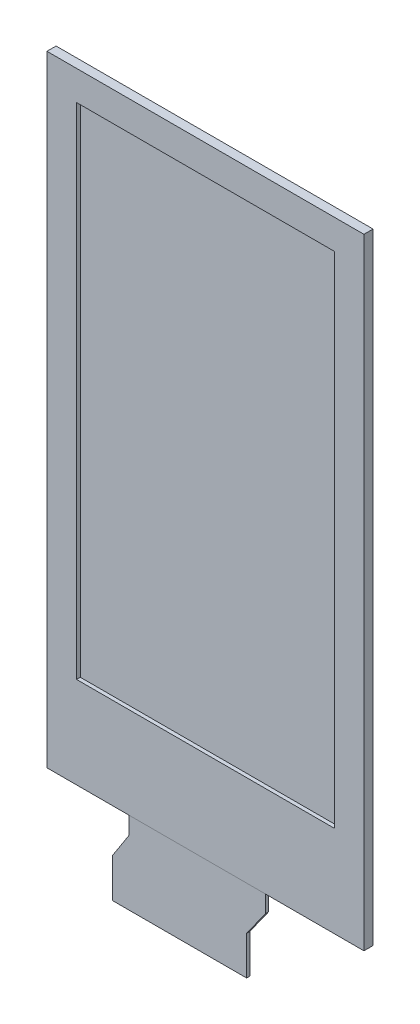
ISO-10303-21;
HEADER;
FILE_DESCRIPTION(('STEP AP214'),'2;1');
FILE_NAME('part.step','',(''),(''),'','','');
FILE_SCHEMA(('AUTOMOTIVE_DESIGN { 1 0 10303 214 1 1 1 1 }'));
ENDSEC;
DATA;
#1=APPLICATION_CONTEXT('core data for automotive mechanical design processes');
#2=APPLICATION_PROTOCOL_DEFINITION('international standard','automotive_design',2000,#1);
#3=PRODUCT_CONTEXT('',#1,'mechanical');
#4=PRODUCT('Part','Part','',(#3));
#5=PRODUCT_RELATED_PRODUCT_CATEGORY('part','',(#4));
#6=PRODUCT_DEFINITION_FORMATION('','',#4);
#7=PRODUCT_DEFINITION_CONTEXT('part definition',#1,'design');
#8=PRODUCT_DEFINITION('design','',#6,#7);
#9=PRODUCT_DEFINITION_SHAPE('','',#8);
#10=(LENGTH_UNIT() NAMED_UNIT(*) SI_UNIT(.MILLI.,.METRE.));
#11=(NAMED_UNIT(*) PLANE_ANGLE_UNIT() SI_UNIT($,.RADIAN.));
#12=(NAMED_UNIT(*) SI_UNIT($,.STERADIAN.) SOLID_ANGLE_UNIT());
#13=UNCERTAINTY_MEASURE_WITH_UNIT(LENGTH_MEASURE(1.E-05),#10,'distance_accuracy_value','');
#14=(GEOMETRIC_REPRESENTATION_CONTEXT(3) GLOBAL_UNCERTAINTY_ASSIGNED_CONTEXT((#13)) GLOBAL_UNIT_ASSIGNED_CONTEXT((#10,
#11,#12)) REPRESENTATION_CONTEXT('',''));
#15=CARTESIAN_POINT('',(0.,0.,0.));
#16=DIRECTION('',(0.,0.,1.));
#17=DIRECTION('',(1.,0.,0.));
#18=AXIS2_PLACEMENT_3D('',#15,#16,#17);
#19=CARTESIAN_POINT('',(19.4468212315687,-13.8527761819744,0.8));
#20=DIRECTION('',(-0.814481793298275,0.58018911432879,0.));
#21=DIRECTION('',(-0.58018911432879,-0.814481793298275,0.));
#22=AXIS2_PLACEMENT_3D('',#19,#20,#21);
#23=PLANE('',#22);
#24=DIRECTION('',(0.580189114328791,0.814481793298275,0.));
#25=VECTOR('',#24,1.);
#26=CARTESIAN_POINT('',(19.4468212315687,-13.8527761819744,0.5));
#27=LINE('',#26,#25);
#28=CARTESIAN_POINT('',(3.778,-35.849,0.5));
#29=VERTEX_POINT('',#28);
#30=CARTESIAN_POINT('',(5.51818223855442,-33.4060952378806,0.5));
#31=VERTEX_POINT('',#30);
#32=EDGE_CURVE('E144',#29,#31,#27,.T.);
#33=ORIENTED_EDGE('',*,*,#32,.T.);
#34=DIRECTION('',(0.,0.,-1.));
#35=VECTOR('',#34,1.);
#36=CARTESIAN_POINT('',(5.51818223855442,-33.4060952378806,0.8));
#37=LINE('',#36,#35);
#38=CARTESIAN_POINT('',(5.51818223855442,-33.4060952378806,0.8));
#39=VERTEX_POINT('',#38);
#40=EDGE_CURVE('E12',#39,#31,#37,.T.);
#41=ORIENTED_EDGE('',*,*,#40,.F.);
#42=DIRECTION('',(0.580189114328791,0.814481793298275,0.));
#43=VECTOR('',#42,1.);
#44=CARTESIAN_POINT('',(19.4468212315687,-13.8527761819744,0.8));
#45=LINE('',#44,#43);
#46=CARTESIAN_POINT('',(3.778,-35.849,0.8));
#47=VERTEX_POINT('',#46);
#48=EDGE_CURVE('E158',#47,#39,#45,.T.);
#49=ORIENTED_EDGE('',*,*,#48,.F.);
#50=DIRECTION('',(0.,0.,-1.));
#51=VECTOR('',#50,1.);
#52=CARTESIAN_POINT('',(3.778,-35.849,0.8));
#53=LINE('',#52,#51);
#54=EDGE_CURVE('E140',#47,#29,#53,.T.);
#55=ORIENTED_EDGE('',*,*,#54,.T.);
#56=EDGE_LOOP('',(#33,#41,#49,#55));
#57=FACE_BOUND('',#56,.T.);
#58=ADVANCED_FACE('F48',(#57),#23,.F.);
#59=CARTESIAN_POINT('',(5.51818223855444,0.,0.8));
#60=DIRECTION('',(-1.,0.,0.));
#61=DIRECTION('',(0.,-1.,0.));
#62=AXIS2_PLACEMENT_3D('',#59,#60,#61);
#63=PLANE('',#62);
#64=DIRECTION('',(0.,1.,0.));
#65=VECTOR('',#64,1.);
#66=CARTESIAN_POINT('',(5.51818223855444,0.,0.5));
#67=LINE('',#66,#65);
#68=CARTESIAN_POINT('',(5.51818223855443,-31.75,0.5));
#69=VERTEX_POINT('',#68);
#70=EDGE_CURVE('E147',#31,#69,#67,.T.);
#71=ORIENTED_EDGE('',*,*,#70,.T.);
#72=DIRECTION('',(0.,0.,-1.));
#73=VECTOR('',#72,1.);
#74=CARTESIAN_POINT('',(5.51818223855443,-31.75,0.8));
#75=LINE('',#74,#73);
#76=CARTESIAN_POINT('',(5.51818223855443,-31.75,0.8));
#77=VERTEX_POINT('',#76);
#78=EDGE_CURVE('E56',#77,#69,#75,.T.);
#79=ORIENTED_EDGE('',*,*,#78,.F.);
#80=DIRECTION('',(0.,1.,0.));
#81=VECTOR('',#80,1.);
#82=CARTESIAN_POINT('',(5.51818223855444,0.,0.8));
#83=LINE('',#82,#81);
#84=EDGE_CURVE('E107',#39,#77,#83,.T.);
#85=ORIENTED_EDGE('',*,*,#84,.F.);
#86=ORIENTED_EDGE('',*,*,#40,.T.);
#87=EDGE_LOOP('',(#71,#79,#85,#86));
#88=FACE_BOUND('',#87,.T.);
#89=ADVANCED_FACE('F193',(#88),#63,.F.);
#90=CARTESIAN_POINT('',(0.,-31.75,0.8));
#91=DIRECTION('',(0.,-1.,0.));
#92=DIRECTION('',(0.,0.,-1.));
#93=AXIS2_PLACEMENT_3D('',#90,#91,#92);
#94=PLANE('',#93);
#95=DIRECTION('',(-1.,0.,0.));
#96=VECTOR('',#95,1.);
#97=CARTESIAN_POINT('',(0.,-31.75,0.5));
#98=LINE('',#97,#96);
#99=CARTESIAN_POINT('',(-7.152,-31.75,0.5));
#100=VERTEX_POINT('',#99);
#101=EDGE_CURVE('E149',#69,#100,#98,.T.);
#102=ORIENTED_EDGE('',*,*,#101,.T.);
#103=DIRECTION('',(0.,0.,-1.));
#104=VECTOR('',#103,1.);
#105=CARTESIAN_POINT('',(-7.152,-31.75,0.8));
#106=LINE('',#105,#104);
#107=CARTESIAN_POINT('',(-7.152,-31.75,0.8));
#108=VERTEX_POINT('',#107);
#109=EDGE_CURVE('E165',#108,#100,#106,.T.);
#110=ORIENTED_EDGE('',*,*,#109,.F.);
#111=DIRECTION('',(-1.,0.,0.));
#112=VECTOR('',#111,1.);
#113=CARTESIAN_POINT('',(0.,-31.75,0.8));
#114=LINE('',#113,#112);
#115=EDGE_CURVE('E173',#77,#108,#114,.T.);
#116=ORIENTED_EDGE('',*,*,#115,.F.);
#117=ORIENTED_EDGE('',*,*,#78,.T.);
#118=EDGE_LOOP('',(#102,#110,#116,#117));
#119=FACE_BOUND('',#118,.T.);
#120=ADVANCED_FACE('F171',(#119),#94,.F.);
#121=CARTESIAN_POINT('',(-7.152,0.,0.8));
#122=DIRECTION('',(1.,0.,0.));
#123=DIRECTION('',(0.,0.,-1.));
#124=AXIS2_PLACEMENT_3D('',#121,#122,#123);
#125=PLANE('',#124);
#126=DIRECTION('',(0.,-1.,0.));
#127=VECTOR('',#126,1.);
#128=CARTESIAN_POINT('',(-7.152,0.,0.5));
#129=LINE('',#128,#127);
#130=CARTESIAN_POINT('',(-7.152,-33.4060952378806,0.5));
#131=VERTEX_POINT('',#130);
#132=EDGE_CURVE('E151',#100,#131,#129,.T.);
#133=ORIENTED_EDGE('',*,*,#132,.T.);
#134=DIRECTION('',(0.,0.,-1.));
#135=VECTOR('',#134,1.);
#136=CARTESIAN_POINT('',(-7.152,-33.4060952378806,0.8));
#137=LINE('',#136,#135);
#138=CARTESIAN_POINT('',(-7.152,-33.4060952378806,0.8));
#139=VERTEX_POINT('',#138);
#140=EDGE_CURVE('E162',#139,#131,#137,.T.);
#141=ORIENTED_EDGE('',*,*,#140,.F.);
#142=DIRECTION('',(0.,-1.,0.));
#143=VECTOR('',#142,1.);
#144=CARTESIAN_POINT('',(-7.152,0.,0.8));
#145=LINE('',#144,#143);
#146=EDGE_CURVE('E185',#108,#139,#145,.T.);
#147=ORIENTED_EDGE('',*,*,#146,.F.);
#148=ORIENTED_EDGE('',*,*,#109,.T.);
#149=EDGE_LOOP('',(#133,#141,#147,#148));
#150=FACE_BOUND('',#149,.T.);
#151=ADVANCED_FACE('F181',(#150),#125,.F.);
#152=CARTESIAN_POINT('',(10.1323412295573,-6.51182804056761,0.8));
#153=DIRECTION('',(0.841247199222074,-0.540650672616817,0.));
#154=DIRECTION('',(0.540650672616817,0.841247199222074,0.));
#155=AXIS2_PLACEMENT_3D('',#152,#153,#154);
#156=PLANE('',#155);
#157=DIRECTION('',(-0.540650672616817,-0.841247199222074,0.));
#158=VECTOR('',#157,1.);
#159=CARTESIAN_POINT('',(10.1323412295573,-6.51182804056761,0.5));
#160=LINE('',#159,#158);
#161=CARTESIAN_POINT('',(-8.722,-35.849,0.5));
#162=VERTEX_POINT('',#161);
#163=EDGE_CURVE('E153',#131,#162,#160,.T.);
#164=ORIENTED_EDGE('',*,*,#163,.T.);
#165=DIRECTION('',(0.,0.,-1.));
#166=VECTOR('',#165,1.);
#167=CARTESIAN_POINT('',(-8.722,-35.849,0.8));
#168=LINE('',#167,#166);
#169=CARTESIAN_POINT('',(-8.722,-35.849,0.8));
#170=VERTEX_POINT('',#169);
#171=EDGE_CURVE('E135',#170,#162,#168,.T.);
#172=ORIENTED_EDGE('',*,*,#171,.F.);
#173=DIRECTION('',(-0.540650672616817,-0.841247199222074,0.));
#174=VECTOR('',#173,1.);
#175=CARTESIAN_POINT('',(10.1323412295573,-6.51182804056761,0.8));
#176=LINE('',#175,#174);
#177=EDGE_CURVE('E126',#139,#170,#176,.T.);
#178=ORIENTED_EDGE('',*,*,#177,.F.);
#179=ORIENTED_EDGE('',*,*,#140,.T.);
#180=EDGE_LOOP('',(#164,#172,#178,#179));
#181=FACE_BOUND('',#180,.T.);
#182=ADVANCED_FACE('F184',(#181),#156,.F.);
#183=CARTESIAN_POINT('',(-8.722,0.,0.8));
#184=DIRECTION('',(1.,0.,0.));
#185=DIRECTION('',(0.,0.,-1.));
#186=AXIS2_PLACEMENT_3D('',#183,#184,#185);
#187=PLANE('',#186);
#188=DIRECTION('',(0.,-1.,0.));
#189=VECTOR('',#188,1.);
#190=CARTESIAN_POINT('',(-8.722,0.,0.5));
#191=LINE('',#190,#189);
#192=CARTESIAN_POINT('',(-8.722,-39.45,0.5));
#193=VERTEX_POINT('',#192);
#194=EDGE_CURVE('E134',#162,#193,#191,.T.);
#195=ORIENTED_EDGE('',*,*,#194,.T.);
#196=DIRECTION('',(0.,0.,-1.));
#197=VECTOR('',#196,1.);
#198=CARTESIAN_POINT('',(-8.722,-39.45,0.8));
#199=LINE('',#198,#197);
#200=CARTESIAN_POINT('',(-8.722,-39.45,0.8));
#201=VERTEX_POINT('',#200);
#202=EDGE_CURVE('E131',#201,#193,#199,.T.);
#203=ORIENTED_EDGE('',*,*,#202,.F.);
#204=DIRECTION('',(0.,-1.,0.));
#205=VECTOR('',#204,1.);
#206=CARTESIAN_POINT('',(-8.722,0.,0.8));
#207=LINE('',#206,#205);
#208=EDGE_CURVE('E120',#170,#201,#207,.T.);
#209=ORIENTED_EDGE('',*,*,#208,.F.);
#210=ORIENTED_EDGE('',*,*,#171,.T.);
#211=EDGE_LOOP('',(#195,#203,#209,#210));
#212=FACE_BOUND('',#211,.T.);
#213=ADVANCED_FACE('F132',(#212),#187,.F.);
#214=CARTESIAN_POINT('',(0.,-39.45,0.8));
#215=DIRECTION('',(0.,1.,0.));
#216=DIRECTION('',(0.,0.,1.));
#217=AXIS2_PLACEMENT_3D('',#214,#215,#216);
#218=PLANE('',#217);
#219=DIRECTION('',(1.,0.,0.));
#220=VECTOR('',#219,1.);
#221=CARTESIAN_POINT('',(0.,-39.45,0.5));
#222=LINE('',#221,#220);
#223=CARTESIAN_POINT('',(3.778,-39.45,0.5));
#224=VERTEX_POINT('',#223);
#225=EDGE_CURVE('E93',#193,#224,#222,.T.);
#226=ORIENTED_EDGE('',*,*,#225,.T.);
#227=DIRECTION('',(0.,0.,-1.));
#228=VECTOR('',#227,1.);
#229=CARTESIAN_POINT('',(3.778,-39.45,0.8));
#230=LINE('',#229,#228);
#231=CARTESIAN_POINT('',(3.778,-39.45,0.8));
#232=VERTEX_POINT('',#231);
#233=EDGE_CURVE('E136',#232,#224,#230,.T.);
#234=ORIENTED_EDGE('',*,*,#233,.F.);
#235=DIRECTION('',(1.,0.,0.));
#236=VECTOR('',#235,1.);
#237=CARTESIAN_POINT('',(0.,-39.45,0.8));
#238=LINE('',#237,#236);
#239=EDGE_CURVE('E124',#201,#232,#238,.T.);
#240=ORIENTED_EDGE('',*,*,#239,.F.);
#241=ORIENTED_EDGE('',*,*,#202,.T.);
#242=EDGE_LOOP('',(#226,#234,#240,#241));
#243=FACE_BOUND('',#242,.T.);
#244=ADVANCED_FACE('F138',(#243),#218,.F.);
#245=CARTESIAN_POINT('',(3.778,0.,0.8));
#246=DIRECTION('',(-1.,0.,0.));
#247=DIRECTION('',(0.,0.,1.));
#248=AXIS2_PLACEMENT_3D('',#245,#246,#247);
#249=PLANE('',#248);
#250=DIRECTION('',(0.,1.,0.));
#251=VECTOR('',#250,1.);
#252=CARTESIAN_POINT('',(3.778,0.,0.5));
#253=LINE('',#252,#251);
#254=EDGE_CURVE('E99',#224,#29,#253,.T.);
#255=ORIENTED_EDGE('',*,*,#254,.T.);
#256=ORIENTED_EDGE('',*,*,#54,.F.);
#257=DIRECTION('',(0.,1.,0.));
#258=VECTOR('',#257,1.);
#259=CARTESIAN_POINT('',(3.778,0.,0.8));
#260=LINE('',#259,#258);
#261=EDGE_CURVE('E64',#232,#47,#260,.T.);
#262=ORIENTED_EDGE('',*,*,#261,.F.);
#263=ORIENTED_EDGE('',*,*,#233,.T.);
#264=EDGE_LOOP('',(#255,#256,#262,#263));
#265=FACE_BOUND('',#264,.T.);
#266=ADVANCED_FACE('F209',(#265),#249,.F.);
#267=CARTESIAN_POINT('',(0.,0.,0.8));
#268=DIRECTION('',(0.,0.,1.));
#269=DIRECTION('',(1.,0.,0.));
#270=AXIS2_PLACEMENT_3D('',#267,#268,#269);
#271=PLANE('',#270);
#272=ORIENTED_EDGE('',*,*,#48,.T.);
#273=ORIENTED_EDGE('',*,*,#84,.T.);
#274=ORIENTED_EDGE('',*,*,#115,.T.);
#275=ORIENTED_EDGE('',*,*,#146,.T.);
#276=ORIENTED_EDGE('',*,*,#177,.T.);
#277=ORIENTED_EDGE('',*,*,#208,.T.);
#278=ORIENTED_EDGE('',*,*,#239,.T.);
#279=ORIENTED_EDGE('',*,*,#261,.T.);
#280=EDGE_LOOP('',(#272,#273,#274,#275,#276,#277,#278,#279));
#281=FACE_BOUND('',#280,.T.);
#282=ADVANCED_FACE('F122',(#281),#271,.T.);
#283=CARTESIAN_POINT('',(0.,0.,0.5));
#284=DIRECTION('',(0.,0.,1.));
#285=DIRECTION('',(1.,0.,0.));
#286=AXIS2_PLACEMENT_3D('',#283,#284,#285);
#287=PLANE('',#286);
#288=ORIENTED_EDGE('',*,*,#32,.F.);
#289=ORIENTED_EDGE('',*,*,#254,.F.);
#290=ORIENTED_EDGE('',*,*,#225,.F.);
#291=ORIENTED_EDGE('',*,*,#194,.F.);
#292=ORIENTED_EDGE('',*,*,#163,.F.);
#293=ORIENTED_EDGE('',*,*,#132,.F.);
#294=ORIENTED_EDGE('',*,*,#101,.F.);
#295=ORIENTED_EDGE('',*,*,#70,.F.);
#296=EDGE_LOOP('',(#288,#289,#290,#291,#292,#293,#294,#295));
#297=FACE_BOUND('',#296,.T.);
#298=ADVANCED_FACE('F177',(#297),#287,.F.);
#299=CLOSED_SHELL('',(#58,#89,#120,#151,#182,#213,#244,#266,#282,#298));
#300=MANIFOLD_SOLID_BREP('B2',#299);
#301=CARTESIAN_POINT('',(0.,26.,0.85));
#302=DIRECTION('',(0.,-1.,0.));
#303=DIRECTION('',(0.,0.,-1.));
#304=AXIS2_PLACEMENT_3D('',#301,#302,#303);
#305=PLANE('',#304);
#306=DIRECTION('',(-1.,0.,0.));
#307=VECTOR('',#306,1.);
#308=CARTESIAN_POINT('',(0.,26.,0.));
#309=LINE('',#308,#307);
#310=CARTESIAN_POINT('',(14.748,26.,0.));
#311=VERTEX_POINT('',#310);
#312=CARTESIAN_POINT('',(-14.752,26.,0.));
#313=VERTEX_POINT('',#312);
#314=EDGE_CURVE('E392',#311,#313,#309,.T.);
#315=ORIENTED_EDGE('',*,*,#314,.T.);
#316=DIRECTION('',(0.,0.,-1.));
#317=VECTOR('',#316,1.);
#318=CARTESIAN_POINT('',(-14.752,26.,0.85));
#319=LINE('',#318,#317);
#320=CARTESIAN_POINT('',(-14.752,26.,0.85));
#321=VERTEX_POINT('',#320);
#322=EDGE_CURVE('E46',#321,#313,#319,.T.);
#323=ORIENTED_EDGE('',*,*,#322,.F.);
#324=DIRECTION('',(-1.,0.,0.));
#325=VECTOR('',#324,1.);
#326=CARTESIAN_POINT('',(0.,26.,0.85));
#327=LINE('',#326,#325);
#328=CARTESIAN_POINT('',(14.748,26.,0.85));
#329=VERTEX_POINT('',#328);
#330=EDGE_CURVE('E364',#329,#321,#327,.T.);
#331=ORIENTED_EDGE('',*,*,#330,.F.);
#332=DIRECTION('',(0.,0.,-1.));
#333=VECTOR('',#332,1.);
#334=CARTESIAN_POINT('',(14.748,26.,0.85));
#335=LINE('',#334,#333);
#336=EDGE_CURVE('E304',#329,#311,#335,.T.);
#337=ORIENTED_EDGE('',*,*,#336,.T.);
#338=EDGE_LOOP('',(#315,#323,#331,#337));
#339=FACE_BOUND('',#338,.T.);
#340=ADVANCED_FACE('F285',(#339),#305,.F.);
#341=CARTESIAN_POINT('',(-14.752,0.,0.85));
#342=DIRECTION('',(1.,0.,0.));
#343=DIRECTION('',(0.,0.,-1.));
#344=AXIS2_PLACEMENT_3D('',#341,#342,#343);
#345=PLANE('',#344);
#346=DIRECTION('',(0.,-1.,0.));
#347=VECTOR('',#346,1.);
#348=CARTESIAN_POINT('',(-14.752,0.,0.));
#349=LINE('',#348,#347);
#350=CARTESIAN_POINT('',(-14.752,-31.75,0.));
#351=VERTEX_POINT('',#350);
#352=EDGE_CURVE('E370',#313,#351,#349,.T.);
#353=ORIENTED_EDGE('',*,*,#352,.T.);
#354=DIRECTION('',(0.,0.,-1.));
#355=VECTOR('',#354,1.);
#356=CARTESIAN_POINT('',(-14.752,-31.75,0.85));
#357=LINE('',#356,#355);
#358=CARTESIAN_POINT('',(-14.752,-31.75,0.85));
#359=VERTEX_POINT('',#358);
#360=EDGE_CURVE('E295',#359,#351,#357,.T.);
#361=ORIENTED_EDGE('',*,*,#360,.F.);
#362=DIRECTION('',(0.,-1.,0.));
#363=VECTOR('',#362,1.);
#364=CARTESIAN_POINT('',(-14.752,0.,0.85));
#365=LINE('',#364,#363);
#366=EDGE_CURVE('E358',#321,#359,#365,.T.);
#367=ORIENTED_EDGE('',*,*,#366,.F.);
#368=ORIENTED_EDGE('',*,*,#322,.T.);
#369=EDGE_LOOP('',(#353,#361,#367,#368));
#370=FACE_BOUND('',#369,.T.);
#371=ADVANCED_FACE('F369',(#370),#345,.F.);
#372=CARTESIAN_POINT('',(0.,-31.75,0.85));
#373=DIRECTION('',(0.,-1.,0.));
#374=DIRECTION('',(0.,0.,-1.));
#375=AXIS2_PLACEMENT_3D('',#372,#373,#374);
#376=PLANE('',#375);
#377=DIRECTION('',(-1.,0.,0.));
#378=VECTOR('',#377,1.);
#379=CARTESIAN_POINT('',(0.,-31.75,0.));
#380=LINE('',#379,#378);
#381=CARTESIAN_POINT('',(14.748,-31.75,0.));
#382=VERTEX_POINT('',#381);
#383=EDGE_CURVE('E395',#382,#351,#380,.T.);
#384=ORIENTED_EDGE('',*,*,#383,.F.);
#385=DIRECTION('',(0.,0.,-1.));
#386=VECTOR('',#385,1.);
#387=CARTESIAN_POINT('',(14.748,-31.75,0.85));
#388=LINE('',#387,#386);
#389=CARTESIAN_POINT('',(14.748,-31.75,0.85));
#390=VERTEX_POINT('',#389);
#391=EDGE_CURVE('E330',#390,#382,#388,.T.);
#392=ORIENTED_EDGE('',*,*,#391,.F.);
#393=DIRECTION('',(-1.,0.,0.));
#394=VECTOR('',#393,1.);
#395=CARTESIAN_POINT('',(0.,-31.75,0.85));
#396=LINE('',#395,#394);
#397=EDGE_CURVE('E363',#390,#359,#396,.T.);
#398=ORIENTED_EDGE('',*,*,#397,.T.);
#399=ORIENTED_EDGE('',*,*,#360,.T.);
#400=EDGE_LOOP('',(#384,#392,#398,#399));
#401=FACE_BOUND('',#400,.T.);
#402=ADVANCED_FACE('F374',(#401),#376,.T.);
#403=CARTESIAN_POINT('',(-12.,0.,0.85));
#404=DIRECTION('',(1.,0.,0.));
#405=DIRECTION('',(0.,0.,-1.));
#406=AXIS2_PLACEMENT_3D('',#403,#404,#405);
#407=PLANE('',#406);
#408=DIRECTION('',(0.,-1.,0.));
#409=VECTOR('',#408,1.);
#410=CARTESIAN_POINT('',(-12.,0.,0.));
#411=LINE('',#410,#409);
#412=CARTESIAN_POINT('',(-12.,23.25,0.));
#413=VERTEX_POINT('',#412);
#414=CARTESIAN_POINT('',(-12.,-23.25,0.));
#415=VERTEX_POINT('',#414);
#416=EDGE_CURVE('E381',#413,#415,#411,.T.);
#417=ORIENTED_EDGE('',*,*,#416,.F.);
#418=DIRECTION('',(0.,0.,-1.));
#419=VECTOR('',#418,1.);
#420=CARTESIAN_POINT('',(-12.,23.25,0.85));
#421=LINE('',#420,#419);
#422=CARTESIAN_POINT('',(-12.,23.25,0.85));
#423=VERTEX_POINT('',#422);
#424=EDGE_CURVE('E289',#423,#413,#421,.T.);
#425=ORIENTED_EDGE('',*,*,#424,.F.);
#426=DIRECTION('',(0.,-1.,0.));
#427=VECTOR('',#426,1.);
#428=CARTESIAN_POINT('',(-12.,0.,0.85));
#429=LINE('',#428,#427);
#430=CARTESIAN_POINT('',(-12.,-23.25,0.85));
#431=VERTEX_POINT('',#430);
#432=EDGE_CURVE('E400',#423,#431,#429,.T.);
#433=ORIENTED_EDGE('',*,*,#432,.T.);
#434=DIRECTION('',(0.,0.,-1.));
#435=VECTOR('',#434,1.);
#436=CARTESIAN_POINT('',(-12.,-23.25,0.85));
#437=LINE('',#436,#435);
#438=EDGE_CURVE('E377',#431,#415,#437,.T.);
#439=ORIENTED_EDGE('',*,*,#438,.T.);
#440=EDGE_LOOP('',(#417,#425,#433,#439));
#441=FACE_BOUND('',#440,.T.);
#442=ADVANCED_FACE('F287',(#441),#407,.T.);
#443=CARTESIAN_POINT('',(0.,23.25,0.85));
#444=DIRECTION('',(0.,-1.,0.));
#445=DIRECTION('',(0.,0.,-1.));
#446=AXIS2_PLACEMENT_3D('',#443,#444,#445);
#447=PLANE('',#446);
#448=DIRECTION('',(-1.,0.,0.));
#449=VECTOR('',#448,1.);
#450=CARTESIAN_POINT('',(0.,23.25,0.));
#451=LINE('',#450,#449);
#452=CARTESIAN_POINT('',(12.,23.25,0.));
#453=VERTEX_POINT('',#452);
#454=EDGE_CURVE('E384',#453,#413,#451,.T.);
#455=ORIENTED_EDGE('',*,*,#454,.F.);
#456=DIRECTION('',(0.,0.,-1.));
#457=VECTOR('',#456,1.);
#458=CARTESIAN_POINT('',(12.,23.25,0.85));
#459=LINE('',#458,#457);
#460=CARTESIAN_POINT('',(12.,23.25,0.85));
#461=VERTEX_POINT('',#460);
#462=EDGE_CURVE('E406',#461,#453,#459,.T.);
#463=ORIENTED_EDGE('',*,*,#462,.F.);
#464=DIRECTION('',(-1.,0.,0.));
#465=VECTOR('',#464,1.);
#466=CARTESIAN_POINT('',(0.,23.25,0.85));
#467=LINE('',#466,#465);
#468=EDGE_CURVE('E415',#461,#423,#467,.T.);
#469=ORIENTED_EDGE('',*,*,#468,.T.);
#470=ORIENTED_EDGE('',*,*,#424,.T.);
#471=EDGE_LOOP('',(#455,#463,#469,#470));
#472=FACE_BOUND('',#471,.T.);
#473=ADVANCED_FACE('F413',(#472),#447,.T.);
#474=CARTESIAN_POINT('',(12.,0.,0.85));
#475=DIRECTION('',(1.,0.,0.));
#476=DIRECTION('',(0.,0.,-1.));
#477=AXIS2_PLACEMENT_3D('',#474,#475,#476);
#478=PLANE('',#477);
#479=DIRECTION('',(0.,-1.,0.));
#480=VECTOR('',#479,1.);
#481=CARTESIAN_POINT('',(12.,0.,0.));
#482=LINE('',#481,#480);
#483=CARTESIAN_POINT('',(12.,-23.25,0.));
#484=VERTEX_POINT('',#483);
#485=EDGE_CURVE('E387',#453,#484,#482,.T.);
#486=ORIENTED_EDGE('',*,*,#485,.T.);
#487=DIRECTION('',(0.,0.,-1.));
#488=VECTOR('',#487,1.);
#489=CARTESIAN_POINT('',(12.,-23.25,0.85));
#490=LINE('',#489,#488);
#491=CARTESIAN_POINT('',(12.,-23.25,0.85));
#492=VERTEX_POINT('',#491);
#493=EDGE_CURVE('E404',#492,#484,#490,.T.);
#494=ORIENTED_EDGE('',*,*,#493,.F.);
#495=DIRECTION('',(0.,-1.,0.));
#496=VECTOR('',#495,1.);
#497=CARTESIAN_POINT('',(12.,0.,0.85));
#498=LINE('',#497,#496);
#499=EDGE_CURVE('E428',#461,#492,#498,.T.);
#500=ORIENTED_EDGE('',*,*,#499,.F.);
#501=ORIENTED_EDGE('',*,*,#462,.T.);
#502=EDGE_LOOP('',(#486,#494,#500,#501));
#503=FACE_BOUND('',#502,.T.);
#504=ADVANCED_FACE('F422',(#503),#478,.F.);
#505=CARTESIAN_POINT('',(0.,-23.25,0.85));
#506=DIRECTION('',(0.,-1.,0.));
#507=DIRECTION('',(0.,0.,-1.));
#508=AXIS2_PLACEMENT_3D('',#505,#506,#507);
#509=PLANE('',#508);
#510=DIRECTION('',(-1.,0.,0.));
#511=VECTOR('',#510,1.);
#512=CARTESIAN_POINT('',(0.,-23.25,0.));
#513=LINE('',#512,#511);
#514=EDGE_CURVE('E389',#484,#415,#513,.T.);
#515=ORIENTED_EDGE('',*,*,#514,.T.);
#516=ORIENTED_EDGE('',*,*,#438,.F.);
#517=DIRECTION('',(-1.,0.,0.));
#518=VECTOR('',#517,1.);
#519=CARTESIAN_POINT('',(0.,-23.25,0.85));
#520=LINE('',#519,#518);
#521=EDGE_CURVE('E426',#492,#431,#520,.T.);
#522=ORIENTED_EDGE('',*,*,#521,.F.);
#523=ORIENTED_EDGE('',*,*,#493,.T.);
#524=EDGE_LOOP('',(#515,#516,#522,#523));
#525=FACE_BOUND('',#524,.T.);
#526=ADVANCED_FACE('F425',(#525),#509,.F.);
#527=CARTESIAN_POINT('',(14.748,0.,0.85));
#528=DIRECTION('',(1.,0.,0.));
#529=DIRECTION('',(0.,0.,-1.));
#530=AXIS2_PLACEMENT_3D('',#527,#528,#529);
#531=PLANE('',#530);
#532=DIRECTION('',(0.,-1.,0.));
#533=VECTOR('',#532,1.);
#534=CARTESIAN_POINT('',(14.748,0.,0.));
#535=LINE('',#534,#533);
#536=EDGE_CURVE('E397',#311,#382,#535,.T.);
#537=ORIENTED_EDGE('',*,*,#536,.F.);
#538=ORIENTED_EDGE('',*,*,#336,.F.);
#539=DIRECTION('',(0.,-1.,0.));
#540=VECTOR('',#539,1.);
#541=CARTESIAN_POINT('',(14.748,0.,0.85));
#542=LINE('',#541,#540);
#543=EDGE_CURVE('E375',#329,#390,#542,.T.);
#544=ORIENTED_EDGE('',*,*,#543,.T.);
#545=ORIENTED_EDGE('',*,*,#391,.T.);
#546=EDGE_LOOP('',(#537,#538,#544,#545));
#547=FACE_BOUND('',#546,.T.);
#548=ADVANCED_FACE('F434',(#547),#531,.T.);
#549=CARTESIAN_POINT('',(0.,0.,0.85));
#550=DIRECTION('',(0.,0.,1.));
#551=DIRECTION('',(1.,0.,0.));
#552=AXIS2_PLACEMENT_3D('',#549,#550,#551);
#553=PLANE('',#552);
#554=ORIENTED_EDGE('',*,*,#432,.F.);
#555=ORIENTED_EDGE('',*,*,#468,.F.);
#556=ORIENTED_EDGE('',*,*,#499,.T.);
#557=ORIENTED_EDGE('',*,*,#521,.T.);
#558=EDGE_LOOP('',(#554,#555,#556,#557));
#559=FACE_BOUND('',#558,.T.);
#560=ORIENTED_EDGE('',*,*,#330,.T.);
#561=ORIENTED_EDGE('',*,*,#366,.T.);
#562=ORIENTED_EDGE('',*,*,#397,.F.);
#563=ORIENTED_EDGE('',*,*,#543,.F.);
#564=EDGE_LOOP('',(#560,#561,#562,#563));
#565=FACE_BOUND('',#564,.T.);
#566=ADVANCED_FACE('F360',(#559,#565),#553,.T.);
#567=CARTESIAN_POINT('',(0.,0.,0.));
#568=DIRECTION('',(0.,0.,1.));
#569=DIRECTION('',(1.,0.,0.));
#570=AXIS2_PLACEMENT_3D('',#567,#568,#569);
#571=PLANE('',#570);
#572=ORIENTED_EDGE('',*,*,#416,.T.);
#573=ORIENTED_EDGE('',*,*,#514,.F.);
#574=ORIENTED_EDGE('',*,*,#485,.F.);
#575=ORIENTED_EDGE('',*,*,#454,.T.);
#576=EDGE_LOOP('',(#572,#573,#574,#575));
#577=FACE_BOUND('',#576,.T.);
#578=ORIENTED_EDGE('',*,*,#314,.F.);
#579=ORIENTED_EDGE('',*,*,#536,.T.);
#580=ORIENTED_EDGE('',*,*,#383,.T.);
#581=ORIENTED_EDGE('',*,*,#352,.F.);
#582=EDGE_LOOP('',(#578,#579,#580,#581));
#583=FACE_BOUND('',#582,.T.);
#584=ADVANCED_FACE('F419',(#577,#583),#571,.F.);
#585=CLOSED_SHELL('',(#340,#371,#402,#442,#473,#504,#526,#548,#566,#584));
#586=MANIFOLD_SOLID_BREP('B6',#585);
#587=CARTESIAN_POINT('',(0.,23.25,0.5));
#588=DIRECTION('',(0.,-1.,0.));
#589=DIRECTION('',(0.,0.,-1.));
#590=AXIS2_PLACEMENT_3D('',#587,#588,#589);
#591=PLANE('',#590);
#592=DIRECTION('',(-1.,0.,0.));
#593=VECTOR('',#592,1.);
#594=CARTESIAN_POINT('',(0.,23.25,0.));
#595=LINE('',#594,#593);
#596=CARTESIAN_POINT('',(12.,23.25,0.));
#597=VERTEX_POINT('',#596);
#598=CARTESIAN_POINT('',(-12.,23.25,0.));
#599=VERTEX_POINT('',#598);
#600=EDGE_CURVE('E578',#597,#599,#595,.T.);
#601=ORIENTED_EDGE('',*,*,#600,.T.);
#602=DIRECTION('',(0.,0.,-1.));
#603=VECTOR('',#602,1.);
#604=CARTESIAN_POINT('',(-12.,23.25,0.5));
#605=LINE('',#604,#603);
#606=CARTESIAN_POINT('',(-12.,23.25,0.5));
#607=VERTEX_POINT('',#606);
#608=EDGE_CURVE('E283',#607,#599,#605,.T.);
#609=ORIENTED_EDGE('',*,*,#608,.F.);
#610=DIRECTION('',(-1.,0.,0.));
#611=VECTOR('',#610,1.);
#612=CARTESIAN_POINT('',(0.,23.25,0.5));
#613=LINE('',#612,#611);
#614=CARTESIAN_POINT('',(12.,23.25,0.5));
#615=VERTEX_POINT('',#614);
#616=EDGE_CURVE('E564',#615,#607,#613,.T.);
#617=ORIENTED_EDGE('',*,*,#616,.F.);
#618=DIRECTION('',(0.,0.,-1.));
#619=VECTOR('',#618,1.);
#620=CARTESIAN_POINT('',(12.,23.25,0.5));
#621=LINE('',#620,#619);
#622=EDGE_CURVE('E531',#615,#597,#621,.T.);
#623=ORIENTED_EDGE('',*,*,#622,.T.);
#624=EDGE_LOOP('',(#601,#609,#617,#623));
#625=FACE_BOUND('',#624,.T.);
#626=ADVANCED_FACE('F515',(#625),#591,.F.);
#627=CARTESIAN_POINT('',(-12.,0.,0.5));
#628=DIRECTION('',(1.,0.,0.));
#629=DIRECTION('',(0.,0.,-1.));
#630=AXIS2_PLACEMENT_3D('',#627,#628,#629);
#631=PLANE('',#630);
#632=DIRECTION('',(0.,-1.,0.));
#633=VECTOR('',#632,1.);
#634=CARTESIAN_POINT('',(-12.,0.,0.));
#635=LINE('',#634,#633);
#636=CARTESIAN_POINT('',(-12.,-23.25,0.));
#637=VERTEX_POINT('',#636);
#638=EDGE_CURVE('E569',#599,#637,#635,.T.);
#639=ORIENTED_EDGE('',*,*,#638,.T.);
#640=DIRECTION('',(0.,0.,-1.));
#641=VECTOR('',#640,1.);
#642=CARTESIAN_POINT('',(-12.,-23.25,0.5));
#643=LINE('',#642,#641);
#644=CARTESIAN_POINT('',(-12.,-23.25,0.5));
#645=VERTEX_POINT('',#644);
#646=EDGE_CURVE('E523',#645,#637,#643,.T.);
#647=ORIENTED_EDGE('',*,*,#646,.F.);
#648=DIRECTION('',(0.,-1.,0.));
#649=VECTOR('',#648,1.);
#650=CARTESIAN_POINT('',(-12.,0.,0.5));
#651=LINE('',#650,#649);
#652=EDGE_CURVE('E556',#607,#645,#651,.T.);
#653=ORIENTED_EDGE('',*,*,#652,.F.);
#654=ORIENTED_EDGE('',*,*,#608,.T.);
#655=EDGE_LOOP('',(#639,#647,#653,#654));
#656=FACE_BOUND('',#655,.T.);
#657=ADVANCED_FACE('F568',(#656),#631,.F.);
#658=CARTESIAN_POINT('',(0.,-23.25,0.5));
#659=DIRECTION('',(0.,-1.,0.));
#660=DIRECTION('',(0.,0.,-1.));
#661=AXIS2_PLACEMENT_3D('',#658,#659,#660);
#662=PLANE('',#661);
#663=DIRECTION('',(-1.,0.,0.));
#664=VECTOR('',#663,1.);
#665=CARTESIAN_POINT('',(0.,-23.25,0.));
#666=LINE('',#665,#664);
#667=CARTESIAN_POINT('',(12.,-23.25,0.));
#668=VERTEX_POINT('',#667);
#669=EDGE_CURVE('E581',#668,#637,#666,.T.);
#670=ORIENTED_EDGE('',*,*,#669,.F.);
#671=DIRECTION('',(0.,0.,-1.));
#672=VECTOR('',#671,1.);
#673=CARTESIAN_POINT('',(12.,-23.25,0.5));
#674=LINE('',#673,#672);
#675=CARTESIAN_POINT('',(12.,-23.25,0.5));
#676=VERTEX_POINT('',#675);
#677=EDGE_CURVE('E545',#676,#668,#674,.T.);
#678=ORIENTED_EDGE('',*,*,#677,.F.);
#679=DIRECTION('',(-1.,0.,0.));
#680=VECTOR('',#679,1.);
#681=CARTESIAN_POINT('',(0.,-23.25,0.5));
#682=LINE('',#681,#680);
#683=EDGE_CURVE('E563',#676,#645,#682,.T.);
#684=ORIENTED_EDGE('',*,*,#683,.T.);
#685=ORIENTED_EDGE('',*,*,#646,.T.);
#686=EDGE_LOOP('',(#670,#678,#684,#685));
#687=FACE_BOUND('',#686,.T.);
#688=ADVANCED_FACE('F572',(#687),#662,.T.);
#689=CARTESIAN_POINT('',(12.,0.,0.5));
#690=DIRECTION('',(1.,0.,0.));
#691=DIRECTION('',(0.,0.,-1.));
#692=AXIS2_PLACEMENT_3D('',#689,#690,#691);
#693=PLANE('',#692);
#694=DIRECTION('',(0.,-1.,0.));
#695=VECTOR('',#694,1.);
#696=CARTESIAN_POINT('',(12.,0.,0.));
#697=LINE('',#696,#695);
#698=EDGE_CURVE('E583',#597,#668,#697,.T.);
#699=ORIENTED_EDGE('',*,*,#698,.F.);
#700=ORIENTED_EDGE('',*,*,#622,.F.);
#701=DIRECTION('',(0.,-1.,0.));
#702=VECTOR('',#701,1.);
#703=CARTESIAN_POINT('',(12.,0.,0.5));
#704=LINE('',#703,#702);
#705=EDGE_CURVE('E573',#615,#676,#704,.T.);
#706=ORIENTED_EDGE('',*,*,#705,.T.);
#707=ORIENTED_EDGE('',*,*,#677,.T.);
#708=EDGE_LOOP('',(#699,#700,#706,#707));
#709=FACE_BOUND('',#708,.T.);
#710=ADVANCED_FACE('F589',(#709),#693,.T.);
#711=CARTESIAN_POINT('',(0.,0.,0.5));
#712=DIRECTION('',(0.,0.,1.));
#713=DIRECTION('',(1.,0.,0.));
#714=AXIS2_PLACEMENT_3D('',#711,#712,#713);
#715=PLANE('',#714);
#716=ORIENTED_EDGE('',*,*,#616,.T.);
#717=ORIENTED_EDGE('',*,*,#652,.T.);
#718=ORIENTED_EDGE('',*,*,#683,.F.);
#719=ORIENTED_EDGE('',*,*,#705,.F.);
#720=EDGE_LOOP('',(#716,#717,#718,#719));
#721=FACE_BOUND('',#720,.T.);
#722=ADVANCED_FACE('F560',(#721),#715,.T.);
#723=CARTESIAN_POINT('',(0.,0.,0.));
#724=DIRECTION('',(0.,0.,1.));
#725=DIRECTION('',(1.,0.,0.));
#726=AXIS2_PLACEMENT_3D('',#723,#724,#725);
#727=PLANE('',#726);
#728=ORIENTED_EDGE('',*,*,#600,.F.);
#729=ORIENTED_EDGE('',*,*,#698,.T.);
#730=ORIENTED_EDGE('',*,*,#669,.T.);
#731=ORIENTED_EDGE('',*,*,#638,.F.);
#732=EDGE_LOOP('',(#728,#729,#730,#731));
#733=FACE_BOUND('',#732,.T.);
#734=ADVANCED_FACE('F588',(#733),#727,.F.);
#735=CLOSED_SHELL('',(#626,#657,#688,#710,#722,#734));
#736=MANIFOLD_SOLID_BREP('B40',#735);
#737=ADVANCED_BREP_SHAPE_REPRESENTATION('',(#18,#300,#586,#736),#14);
#738=SHAPE_DEFINITION_REPRESENTATION(#9,#737);
ENDSEC;
END-ISO-10303-21;
